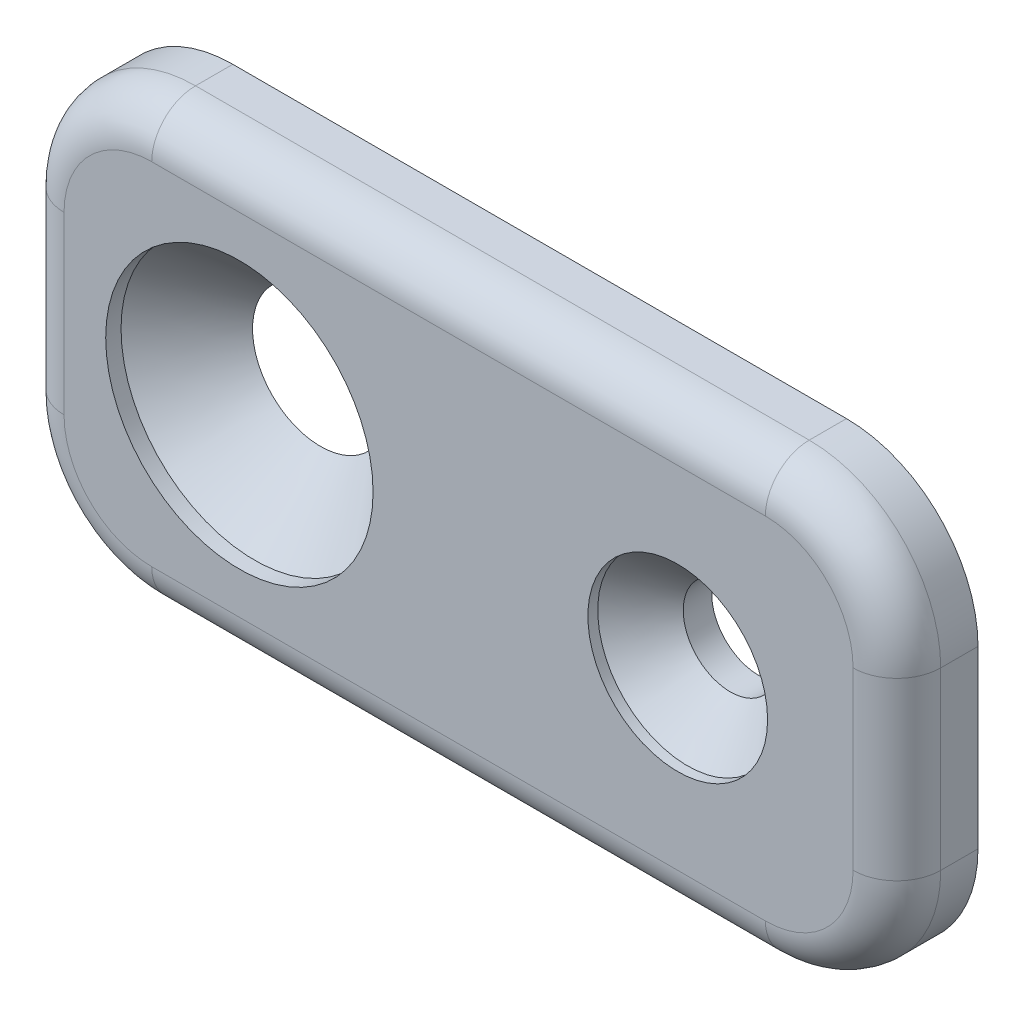
ISO-10303-21;
HEADER;
FILE_DESCRIPTION(('STEP AP214'),'2;1');
FILE_NAME('part.step','',(''),(''),'','','');
FILE_SCHEMA(('AUTOMOTIVE_DESIGN { 1 0 10303 214 1 1 1 1 }'));
ENDSEC;
DATA;
#1=APPLICATION_CONTEXT('core data for automotive mechanical design processes');
#2=APPLICATION_PROTOCOL_DEFINITION('international standard','automotive_design',2000,#1);
#3=PRODUCT_CONTEXT('',#1,'mechanical');
#4=PRODUCT('Part','Part','',(#3));
#5=PRODUCT_RELATED_PRODUCT_CATEGORY('part','',(#4));
#6=PRODUCT_DEFINITION_FORMATION('','',#4);
#7=PRODUCT_DEFINITION_CONTEXT('part definition',#1,'design');
#8=PRODUCT_DEFINITION('design','',#6,#7);
#9=PRODUCT_DEFINITION_SHAPE('','',#8);
#10=(LENGTH_UNIT() NAMED_UNIT(*) SI_UNIT(.MILLI.,.METRE.));
#11=(NAMED_UNIT(*) PLANE_ANGLE_UNIT() SI_UNIT($,.RADIAN.));
#12=(NAMED_UNIT(*) SI_UNIT($,.STERADIAN.) SOLID_ANGLE_UNIT());
#13=UNCERTAINTY_MEASURE_WITH_UNIT(LENGTH_MEASURE(1.E-05),#10,'distance_accuracy_value','');
#14=(GEOMETRIC_REPRESENTATION_CONTEXT(3) GLOBAL_UNCERTAINTY_ASSIGNED_CONTEXT((#13)) GLOBAL_UNIT_ASSIGNED_CONTEXT((#10,
#11,#12)) REPRESENTATION_CONTEXT('',''));
#15=CARTESIAN_POINT('',(0.,0.,0.));
#16=DIRECTION('',(0.,0.,1.));
#17=DIRECTION('',(1.,0.,0.));
#18=AXIS2_PLACEMENT_3D('',#15,#16,#17);
#19=CARTESIAN_POINT('',(20.,0.,3.7));
#20=DIRECTION('',(0.,0.,-1.));
#21=DIRECTION('',(-1.,0.,0.));
#22=AXIS2_PLACEMENT_3D('',#19,#20,#21);
#23=CYLINDRICAL_SURFACE('',#22,2.15);
#24=CARTESIAN_POINT('',(20.,0.,1.29999999999996));
#25=DIRECTION('',(0.,0.,1.));
#26=DIRECTION('',(1.,0.,0.));
#27=AXIS2_PLACEMENT_3D('',#24,#25,#26);
#28=CIRCLE('',#27,2.15);
#29=CARTESIAN_POINT('',(22.15,0.,1.29999999999996));
#30=VERTEX_POINT('',#29);
#31=EDGE_CURVE('E159',#30,#30,#28,.T.);
#32=ORIENTED_EDGE('',*,*,#31,.T.);
#33=EDGE_LOOP('',(#32));
#34=FACE_BOUND('',#33,.T.);
#35=CARTESIAN_POINT('',(20.,0.,0.));
#36=DIRECTION('',(0.,0.,1.));
#37=DIRECTION('',(1.,0.,0.));
#38=AXIS2_PLACEMENT_3D('',#35,#36,#37);
#39=CIRCLE('',#38,2.15);
#40=CARTESIAN_POINT('',(22.15,0.,0.));
#41=VERTEX_POINT('',#40);
#42=EDGE_CURVE('E252',#41,#41,#39,.T.);
#43=ORIENTED_EDGE('',*,*,#42,.F.);
#44=EDGE_LOOP('',(#43));
#45=FACE_BOUND('',#44,.T.);
#46=ADVANCED_FACE('F35',(#34,#45),#23,.F.);
#47=CARTESIAN_POINT('',(0.,0.,3.7));
#48=DIRECTION('',(0.,0.,-1.));
#49=DIRECTION('',(-1.,0.,0.));
#50=AXIS2_PLACEMENT_3D('',#47,#48,#49);
#51=PLANE('',#50);
#52=CARTESIAN_POINT('',(-4.,-4.00000000000001,3.7));
#53=DIRECTION('',(0.,0.,-1.));
#54=DIRECTION('',(-1.,0.,0.));
#55=AXIS2_PLACEMENT_3D('',#52,#53,#54);
#56=CIRCLE('',#55,4.);
#57=CARTESIAN_POINT('',(-8.,-4.00000000000001,3.7));
#58=VERTEX_POINT('',#57);
#59=CARTESIAN_POINT('',(-4.,-8.00000000000001,3.7));
#60=VERTEX_POINT('',#59);
#61=EDGE_CURVE('E185',#58,#60,#56,.F.);
#62=ORIENTED_EDGE('',*,*,#61,.T.);
#63=DIRECTION('',(1.,0.,0.));
#64=VECTOR('',#63,1.);
#65=CARTESIAN_POINT('',(0.,-8.00000000000001,3.7));
#66=LINE('',#65,#64);
#67=CARTESIAN_POINT('',(24.,-8.,3.7));
#68=VERTEX_POINT('',#67);
#69=EDGE_CURVE('E199',#60,#68,#66,.T.);
#70=ORIENTED_EDGE('',*,*,#69,.T.);
#71=CARTESIAN_POINT('',(24.,-4.,3.7));
#72=DIRECTION('',(0.,0.,-1.));
#73=DIRECTION('',(-1.,0.,0.));
#74=AXIS2_PLACEMENT_3D('',#71,#72,#73);
#75=CIRCLE('',#74,4.);
#76=CARTESIAN_POINT('',(28.,-4.,3.7));
#77=VERTEX_POINT('',#76);
#78=EDGE_CURVE('E197',#68,#77,#75,.F.);
#79=ORIENTED_EDGE('',*,*,#78,.T.);
#80=DIRECTION('',(0.,1.,0.));
#81=VECTOR('',#80,1.);
#82=CARTESIAN_POINT('',(28.,0.,3.7));
#83=LINE('',#82,#81);
#84=CARTESIAN_POINT('',(28.,4.,3.7));
#85=VERTEX_POINT('',#84);
#86=EDGE_CURVE('E195',#77,#85,#83,.T.);
#87=ORIENTED_EDGE('',*,*,#86,.T.);
#88=CARTESIAN_POINT('',(24.,4.,3.7));
#89=DIRECTION('',(0.,0.,-1.));
#90=DIRECTION('',(-1.,0.,0.));
#91=AXIS2_PLACEMENT_3D('',#88,#89,#90);
#92=CIRCLE('',#91,4.);
#93=CARTESIAN_POINT('',(24.,8.,3.7));
#94=VERTEX_POINT('',#93);
#95=EDGE_CURVE('E193',#85,#94,#92,.F.);
#96=ORIENTED_EDGE('',*,*,#95,.T.);
#97=DIRECTION('',(-1.,0.,0.));
#98=VECTOR('',#97,1.);
#99=CARTESIAN_POINT('',(0.,7.99999999999999,3.7));
#100=LINE('',#99,#98);
#101=CARTESIAN_POINT('',(-4.,7.99999999999999,3.7));
#102=VERTEX_POINT('',#101);
#103=EDGE_CURVE('E191',#94,#102,#100,.T.);
#104=ORIENTED_EDGE('',*,*,#103,.T.);
#105=CARTESIAN_POINT('',(-4.,3.99999999999999,3.7));
#106=DIRECTION('',(0.,0.,-1.));
#107=DIRECTION('',(-1.,0.,0.));
#108=AXIS2_PLACEMENT_3D('',#105,#106,#107);
#109=CIRCLE('',#108,4.);
#110=CARTESIAN_POINT('',(-8.,3.99999999999999,3.7));
#111=VERTEX_POINT('',#110);
#112=EDGE_CURVE('E189',#102,#111,#109,.F.);
#113=ORIENTED_EDGE('',*,*,#112,.T.);
#114=DIRECTION('',(0.,-1.,0.));
#115=VECTOR('',#114,1.);
#116=CARTESIAN_POINT('',(-8.,0.,3.7));
#117=LINE('',#116,#115);
#118=EDGE_CURVE('E187',#111,#58,#117,.T.);
#119=ORIENTED_EDGE('',*,*,#118,.T.);
#120=EDGE_LOOP('',(#62,#70,#79,#87,#96,#104,#113,#119));
#121=FACE_BOUND('',#120,.T.);
#122=CARTESIAN_POINT('',(20.,0.,3.7));
#123=DIRECTION('',(0.,0.,1.));
#124=DIRECTION('',(1.,0.,0.));
#125=AXIS2_PLACEMENT_3D('',#122,#123,#124);
#126=CIRCLE('',#125,4.1);
#127=CARTESIAN_POINT('',(24.1,0.,3.7));
#128=VERTEX_POINT('',#127);
#129=EDGE_CURVE('E237',#128,#128,#126,.T.);
#130=ORIENTED_EDGE('',*,*,#129,.F.);
#131=EDGE_LOOP('',(#130));
#132=FACE_BOUND('',#131,.T.);
#133=CARTESIAN_POINT('',(0.,0.,3.7));
#134=DIRECTION('',(0.,0.,1.));
#135=DIRECTION('',(1.,0.,0.));
#136=AXIS2_PLACEMENT_3D('',#133,#134,#135);
#137=CIRCLE('',#136,6.1);
#138=CARTESIAN_POINT('',(6.1,0.,3.7));
#139=VERTEX_POINT('',#138);
#140=EDGE_CURVE('E243',#139,#139,#137,.T.);
#141=ORIENTED_EDGE('',*,*,#140,.F.);
#142=EDGE_LOOP('',(#141));
#143=FACE_BOUND('',#142,.T.);
#144=ADVANCED_FACE('F278',(#121,#132,#143),#51,.F.);
#145=CARTESIAN_POINT('',(0.,0.,0.));
#146=DIRECTION('',(0.,0.,-1.));
#147=DIRECTION('',(-1.,0.,0.));
#148=AXIS2_PLACEMENT_3D('',#145,#146,#147);
#149=PLANE('',#148);
#150=CARTESIAN_POINT('',(0.,0.,0.));
#151=DIRECTION('',(0.,0.,1.));
#152=DIRECTION('',(1.,0.,0.));
#153=AXIS2_PLACEMENT_3D('',#150,#151,#152);
#154=CIRCLE('',#153,3.1);
#155=CARTESIAN_POINT('',(3.1,0.,0.));
#156=VERTEX_POINT('',#155);
#157=EDGE_CURVE('E256',#156,#156,#154,.T.);
#158=ORIENTED_EDGE('',*,*,#157,.T.);
#159=EDGE_LOOP('',(#158));
#160=FACE_BOUND('',#159,.T.);
#161=DIRECTION('',(0.,1.,0.));
#162=VECTOR('',#161,1.);
#163=CARTESIAN_POINT('',(30.,10.,0.));
#164=LINE('',#163,#162);
#165=CARTESIAN_POINT('',(30.,-4.,0.));
#166=VERTEX_POINT('',#165);
#167=CARTESIAN_POINT('',(30.,4.,0.));
#168=VERTEX_POINT('',#167);
#169=EDGE_CURVE('E130',#166,#168,#164,.T.);
#170=ORIENTED_EDGE('',*,*,#169,.F.);
#171=CARTESIAN_POINT('',(24.,-4.,0.));
#172=DIRECTION('',(0.,0.,-1.));
#173=DIRECTION('',(-1.,0.,0.));
#174=AXIS2_PLACEMENT_3D('',#171,#172,#173);
#175=CIRCLE('',#174,6.);
#176=CARTESIAN_POINT('',(24.,-10.,0.));
#177=VERTEX_POINT('',#176);
#178=EDGE_CURVE('E140',#166,#177,#175,.T.);
#179=ORIENTED_EDGE('',*,*,#178,.T.);
#180=DIRECTION('',(1.,0.,0.));
#181=VECTOR('',#180,1.);
#182=CARTESIAN_POINT('',(30.,-10.,0.));
#183=LINE('',#182,#181);
#184=CARTESIAN_POINT('',(-4.,-10.,0.));
#185=VERTEX_POINT('',#184);
#186=EDGE_CURVE('E156',#185,#177,#183,.T.);
#187=ORIENTED_EDGE('',*,*,#186,.F.);
#188=CARTESIAN_POINT('',(-4.,-4.00000000000001,0.));
#189=DIRECTION('',(0.,0.,-1.));
#190=DIRECTION('',(-1.,0.,0.));
#191=AXIS2_PLACEMENT_3D('',#188,#189,#190);
#192=CIRCLE('',#191,6.);
#193=CARTESIAN_POINT('',(-10.,-4.00000000000001,0.));
#194=VERTEX_POINT('',#193);
#195=EDGE_CURVE('E148',#185,#194,#192,.T.);
#196=ORIENTED_EDGE('',*,*,#195,.T.);
#197=DIRECTION('',(0.,-1.,0.));
#198=VECTOR('',#197,1.);
#199=CARTESIAN_POINT('',(-10.,9.99999999999999,0.));
#200=LINE('',#199,#198);
#201=CARTESIAN_POINT('',(-10.,3.99999999999999,0.));
#202=VERTEX_POINT('',#201);
#203=EDGE_CURVE('E161',#202,#194,#200,.T.);
#204=ORIENTED_EDGE('',*,*,#203,.F.);
#205=CARTESIAN_POINT('',(-4.,3.99999999999999,0.));
#206=DIRECTION('',(0.,0.,-1.));
#207=DIRECTION('',(-1.,0.,0.));
#208=AXIS2_PLACEMENT_3D('',#205,#206,#207);
#209=CIRCLE('',#208,6.);
#210=CARTESIAN_POINT('',(-4.,9.99999999999999,0.));
#211=VERTEX_POINT('',#210);
#212=EDGE_CURVE('E136',#202,#211,#209,.T.);
#213=ORIENTED_EDGE('',*,*,#212,.T.);
#214=DIRECTION('',(-1.,0.,0.));
#215=VECTOR('',#214,1.);
#216=CARTESIAN_POINT('',(30.,10.,0.));
#217=LINE('',#216,#215);
#218=CARTESIAN_POINT('',(24.,10.,0.));
#219=VERTEX_POINT('',#218);
#220=EDGE_CURVE('E155',#219,#211,#217,.T.);
#221=ORIENTED_EDGE('',*,*,#220,.F.);
#222=CARTESIAN_POINT('',(24.,4.,0.));
#223=DIRECTION('',(0.,0.,-1.));
#224=DIRECTION('',(-1.,0.,0.));
#225=AXIS2_PLACEMENT_3D('',#222,#223,#224);
#226=CIRCLE('',#225,6.);
#227=EDGE_CURVE('E154',#219,#168,#226,.T.);
#228=ORIENTED_EDGE('',*,*,#227,.T.);
#229=EDGE_LOOP('',(#170,#179,#187,#196,#204,#213,#221,#228));
#230=FACE_BOUND('',#229,.T.);
#231=ORIENTED_EDGE('',*,*,#42,.T.);
#232=EDGE_LOOP('',(#231));
#233=FACE_BOUND('',#232,.T.);
#234=ADVANCED_FACE('F150',(#160,#230,#233),#149,.T.);
#235=CARTESIAN_POINT('',(-10.,9.99999999999999,3.7));
#236=DIRECTION('',(1.,0.,0.));
#237=DIRECTION('',(0.,1.,0.));
#238=AXIS2_PLACEMENT_3D('',#235,#236,#237);
#239=PLANE('',#238);
#240=DIRECTION('',(0.,0.,-1.));
#241=VECTOR('',#240,1.);
#242=CARTESIAN_POINT('',(-10.,-4.00000000000001,3.7));
#243=LINE('',#242,#241);
#244=CARTESIAN_POINT('',(-10.,-4.00000000000001,1.7));
#245=VERTEX_POINT('',#244);
#246=EDGE_CURVE('E178',#194,#245,#243,.F.);
#247=ORIENTED_EDGE('',*,*,#246,.T.);
#248=DIRECTION('',(0.,-1.,0.));
#249=VECTOR('',#248,1.);
#250=CARTESIAN_POINT('',(-10.,9.99999999999999,1.7));
#251=LINE('',#250,#249);
#252=CARTESIAN_POINT('',(-10.,3.99999999999999,1.7));
#253=VERTEX_POINT('',#252);
#254=EDGE_CURVE('E44',#245,#253,#251,.F.);
#255=ORIENTED_EDGE('',*,*,#254,.T.);
#256=DIRECTION('',(0.,0.,-1.));
#257=VECTOR('',#256,1.);
#258=CARTESIAN_POINT('',(-10.,3.99999999999999,3.7));
#259=LINE('',#258,#257);
#260=EDGE_CURVE('E176',#253,#202,#259,.T.);
#261=ORIENTED_EDGE('',*,*,#260,.T.);
#262=ORIENTED_EDGE('',*,*,#203,.T.);
#263=EDGE_LOOP('',(#247,#255,#261,#262));
#264=FACE_BOUND('',#263,.T.);
#265=ADVANCED_FACE('F260',(#264),#239,.F.);
#266=CARTESIAN_POINT('',(30.,-10.,3.7));
#267=DIRECTION('',(0.,1.,0.));
#268=DIRECTION('',(-1.,0.,0.));
#269=AXIS2_PLACEMENT_3D('',#266,#267,#268);
#270=PLANE('',#269);
#271=DIRECTION('',(0.,0.,-1.));
#272=VECTOR('',#271,1.);
#273=CARTESIAN_POINT('',(24.,-10.,3.7));
#274=LINE('',#273,#272);
#275=CARTESIAN_POINT('',(24.,-10.,1.7));
#276=VERTEX_POINT('',#275);
#277=EDGE_CURVE('E143',#177,#276,#274,.F.);
#278=ORIENTED_EDGE('',*,*,#277,.T.);
#279=DIRECTION('',(1.,0.,0.));
#280=VECTOR('',#279,1.);
#281=CARTESIAN_POINT('',(30.,-10.,1.7));
#282=LINE('',#281,#280);
#283=CARTESIAN_POINT('',(-4.,-10.,1.7));
#284=VERTEX_POINT('',#283);
#285=EDGE_CURVE('E202',#276,#284,#282,.F.);
#286=ORIENTED_EDGE('',*,*,#285,.T.);
#287=DIRECTION('',(0.,0.,-1.));
#288=VECTOR('',#287,1.);
#289=CARTESIAN_POINT('',(-4.,-10.,3.7));
#290=LINE('',#289,#288);
#291=EDGE_CURVE('E147',#284,#185,#290,.T.);
#292=ORIENTED_EDGE('',*,*,#291,.T.);
#293=ORIENTED_EDGE('',*,*,#186,.T.);
#294=EDGE_LOOP('',(#278,#286,#292,#293));
#295=FACE_BOUND('',#294,.T.);
#296=ADVANCED_FACE('F265',(#295),#270,.F.);
#297=CARTESIAN_POINT('',(30.,10.,3.7));
#298=DIRECTION('',(-1.,0.,0.));
#299=DIRECTION('',(0.,0.,1.));
#300=AXIS2_PLACEMENT_3D('',#297,#298,#299);
#301=PLANE('',#300);
#302=DIRECTION('',(0.,0.,-1.));
#303=VECTOR('',#302,1.);
#304=CARTESIAN_POINT('',(30.,4.,3.7));
#305=LINE('',#304,#303);
#306=CARTESIAN_POINT('',(30.,4.,1.7));
#307=VERTEX_POINT('',#306);
#308=EDGE_CURVE('E137',#168,#307,#305,.F.);
#309=ORIENTED_EDGE('',*,*,#308,.T.);
#310=DIRECTION('',(0.,1.,0.));
#311=VECTOR('',#310,1.);
#312=CARTESIAN_POINT('',(30.,10.,1.7));
#313=LINE('',#312,#311);
#314=CARTESIAN_POINT('',(30.,-4.,1.7));
#315=VERTEX_POINT('',#314);
#316=EDGE_CURVE('E133',#307,#315,#313,.F.);
#317=ORIENTED_EDGE('',*,*,#316,.T.);
#318=DIRECTION('',(0.,0.,-1.));
#319=VECTOR('',#318,1.);
#320=CARTESIAN_POINT('',(30.,-4.,3.7));
#321=LINE('',#320,#319);
#322=EDGE_CURVE('E125',#315,#166,#321,.T.);
#323=ORIENTED_EDGE('',*,*,#322,.T.);
#324=ORIENTED_EDGE('',*,*,#169,.T.);
#325=EDGE_LOOP('',(#309,#317,#323,#324));
#326=FACE_BOUND('',#325,.T.);
#327=ADVANCED_FACE('F128',(#326),#301,.F.);
#328=CARTESIAN_POINT('',(30.,10.,3.7));
#329=DIRECTION('',(0.,-1.,0.));
#330=DIRECTION('',(1.,0.,0.));
#331=AXIS2_PLACEMENT_3D('',#328,#329,#330);
#332=PLANE('',#331);
#333=DIRECTION('',(0.,0.,-1.));
#334=VECTOR('',#333,1.);
#335=CARTESIAN_POINT('',(-4.,9.99999999999999,3.7));
#336=LINE('',#335,#334);
#337=CARTESIAN_POINT('',(-4.,9.99999999999999,1.7));
#338=VERTEX_POINT('',#337);
#339=EDGE_CURVE('E180',#211,#338,#336,.F.);
#340=ORIENTED_EDGE('',*,*,#339,.T.);
#341=DIRECTION('',(-1.,0.,0.));
#342=VECTOR('',#341,1.);
#343=CARTESIAN_POINT('',(30.,10.,1.7));
#344=LINE('',#343,#342);
#345=CARTESIAN_POINT('',(24.,10.,1.7));
#346=VERTEX_POINT('',#345);
#347=EDGE_CURVE('E210',#338,#346,#344,.F.);
#348=ORIENTED_EDGE('',*,*,#347,.T.);
#349=DIRECTION('',(0.,0.,-1.));
#350=VECTOR('',#349,1.);
#351=CARTESIAN_POINT('',(24.,10.,3.7));
#352=LINE('',#351,#350);
#353=EDGE_CURVE('E183',#346,#219,#352,.T.);
#354=ORIENTED_EDGE('',*,*,#353,.T.);
#355=ORIENTED_EDGE('',*,*,#220,.T.);
#356=EDGE_LOOP('',(#340,#348,#354,#355));
#357=FACE_BOUND('',#356,.T.);
#358=ADVANCED_FACE('F294',(#357),#332,.F.);
#359=CARTESIAN_POINT('',(0.,0.,3.));
#360=DIRECTION('',(0.,0.,1.));
#361=DIRECTION('',(1.,0.,0.));
#362=AXIS2_PLACEMENT_3D('',#359,#360,#361);
#363=CYLINDRICAL_SURFACE('',#362,6.1);
#364=CARTESIAN_POINT('',(0.,0.,3.));
#365=DIRECTION('',(0.,0.,1.));
#366=DIRECTION('',(1.,0.,0.));
#367=AXIS2_PLACEMENT_3D('',#364,#365,#366);
#368=CIRCLE('',#367,6.1);
#369=CARTESIAN_POINT('',(6.1,0.,3.));
#370=VERTEX_POINT('',#369);
#371=EDGE_CURVE('E248',#370,#370,#368,.T.);
#372=ORIENTED_EDGE('',*,*,#371,.F.);
#373=EDGE_LOOP('',(#372));
#374=FACE_BOUND('',#373,.T.);
#375=ORIENTED_EDGE('',*,*,#140,.T.);
#376=EDGE_LOOP('',(#375));
#377=FACE_BOUND('',#376,.T.);
#378=ADVANCED_FACE('F319',(#374,#377),#363,.F.);
#379=CARTESIAN_POINT('',(0.,0.,0.));
#380=DIRECTION('',(0.,0.,1.));
#381=DIRECTION('',(1.,0.,0.));
#382=AXIS2_PLACEMENT_3D('',#379,#380,#381);
#383=CONICAL_SURFACE('',#382,3.1,0.78539816339745);
#384=ORIENTED_EDGE('',*,*,#371,.T.);
#385=EDGE_LOOP('',(#384));
#386=FACE_BOUND('',#385,.T.);
#387=ORIENTED_EDGE('',*,*,#157,.F.);
#388=EDGE_LOOP('',(#387));
#389=FACE_BOUND('',#388,.T.);
#390=ADVANCED_FACE('F333',(#386,#389),#383,.F.);
#391=CARTESIAN_POINT('',(20.,0.,3.3));
#392=DIRECTION('',(0.,0.,1.));
#393=DIRECTION('',(1.,0.,0.));
#394=AXIS2_PLACEMENT_3D('',#391,#392,#393);
#395=CYLINDRICAL_SURFACE('',#394,4.1);
#396=CARTESIAN_POINT('',(20.,0.,3.24999999999999));
#397=DIRECTION('',(0.,0.,1.));
#398=DIRECTION('',(1.,0.,0.));
#399=AXIS2_PLACEMENT_3D('',#396,#397,#398);
#400=CIRCLE('',#399,4.1);
#401=CARTESIAN_POINT('',(24.1,0.,3.24999999999999));
#402=VERTEX_POINT('',#401);
#403=EDGE_CURVE('E167',#402,#402,#400,.F.);
#404=ORIENTED_EDGE('',*,*,#403,.T.);
#405=EDGE_LOOP('',(#404));
#406=FACE_BOUND('',#405,.T.);
#407=ORIENTED_EDGE('',*,*,#129,.T.);
#408=EDGE_LOOP('',(#407));
#409=FACE_BOUND('',#408,.T.);
#410=ADVANCED_FACE('F336',(#406,#409),#395,.F.);
#411=CARTESIAN_POINT('',(20.,0.,1.29999999999996));
#412=DIRECTION('',(0.,0.,1.));
#413=DIRECTION('',(1.,0.,0.));
#414=AXIS2_PLACEMENT_3D('',#411,#412,#413);
#415=CONICAL_SURFACE('',#414,2.15,0.785398163397443);
#416=ORIENTED_EDGE('',*,*,#403,.F.);
#417=EDGE_LOOP('',(#416));
#418=FACE_BOUND('',#417,.T.);
#419=ORIENTED_EDGE('',*,*,#31,.F.);
#420=EDGE_LOOP('',(#419));
#421=FACE_BOUND('',#420,.T.);
#422=ADVANCED_FACE('F338',(#418,#421),#415,.F.);
#423=CARTESIAN_POINT('',(24.,-4.,3.7));
#424=DIRECTION('',(0.,0.,-1.));
#425=DIRECTION('',(-1.,0.,0.));
#426=AXIS2_PLACEMENT_3D('',#423,#424,#425);
#427=CYLINDRICAL_SURFACE('',#426,6.);
#428=ORIENTED_EDGE('',*,*,#322,.F.);
#429=CARTESIAN_POINT('',(24.,-4.,1.7));
#430=DIRECTION('',(0.,0.,-1.));
#431=DIRECTION('',(-1.,0.,0.));
#432=AXIS2_PLACEMENT_3D('',#429,#430,#431);
#433=CIRCLE('',#432,6.);
#434=EDGE_CURVE('E205',#315,#276,#433,.T.);
#435=ORIENTED_EDGE('',*,*,#434,.T.);
#436=ORIENTED_EDGE('',*,*,#277,.F.);
#437=ORIENTED_EDGE('',*,*,#178,.F.);
#438=EDGE_LOOP('',(#428,#435,#436,#437));
#439=FACE_BOUND('',#438,.T.);
#440=ADVANCED_FACE('F141',(#439),#427,.T.);
#441=CARTESIAN_POINT('',(-4.,-4.00000000000001,3.7));
#442=DIRECTION('',(0.,0.,-1.));
#443=DIRECTION('',(-1.,0.,0.));
#444=AXIS2_PLACEMENT_3D('',#441,#442,#443);
#445=CYLINDRICAL_SURFACE('',#444,6.);
#446=ORIENTED_EDGE('',*,*,#291,.F.);
#447=CARTESIAN_POINT('',(-4.,-4.00000000000001,1.7));
#448=DIRECTION('',(0.,0.,-1.));
#449=DIRECTION('',(-1.,0.,0.));
#450=AXIS2_PLACEMENT_3D('',#447,#448,#449);
#451=CIRCLE('',#450,6.);
#452=EDGE_CURVE('E11',#284,#245,#451,.T.);
#453=ORIENTED_EDGE('',*,*,#452,.T.);
#454=ORIENTED_EDGE('',*,*,#246,.F.);
#455=ORIENTED_EDGE('',*,*,#195,.F.);
#456=EDGE_LOOP('',(#446,#453,#454,#455));
#457=FACE_BOUND('',#456,.T.);
#458=ADVANCED_FACE('F263',(#457),#445,.T.);
#459=CARTESIAN_POINT('',(24.,4.,3.7));
#460=DIRECTION('',(0.,0.,-1.));
#461=DIRECTION('',(-1.,0.,0.));
#462=AXIS2_PLACEMENT_3D('',#459,#460,#461);
#463=CYLINDRICAL_SURFACE('',#462,6.);
#464=ORIENTED_EDGE('',*,*,#353,.F.);
#465=CARTESIAN_POINT('',(24.,4.,1.7));
#466=DIRECTION('',(0.,0.,-1.));
#467=DIRECTION('',(-1.,0.,0.));
#468=AXIS2_PLACEMENT_3D('',#465,#466,#467);
#469=CIRCLE('',#468,6.);
#470=EDGE_CURVE('E208',#346,#307,#469,.T.);
#471=ORIENTED_EDGE('',*,*,#470,.T.);
#472=ORIENTED_EDGE('',*,*,#308,.F.);
#473=ORIENTED_EDGE('',*,*,#227,.F.);
#474=EDGE_LOOP('',(#464,#471,#472,#473));
#475=FACE_BOUND('',#474,.T.);
#476=ADVANCED_FACE('F301',(#475),#463,.T.);
#477=CARTESIAN_POINT('',(-4.,3.99999999999999,3.7));
#478=DIRECTION('',(0.,0.,-1.));
#479=DIRECTION('',(-1.,0.,0.));
#480=AXIS2_PLACEMENT_3D('',#477,#478,#479);
#481=CYLINDRICAL_SURFACE('',#480,6.);
#482=ORIENTED_EDGE('',*,*,#260,.F.);
#483=CARTESIAN_POINT('',(-4.,3.99999999999999,1.7));
#484=DIRECTION('',(0.,0.,-1.));
#485=DIRECTION('',(-1.,0.,0.));
#486=AXIS2_PLACEMENT_3D('',#483,#484,#485);
#487=CIRCLE('',#486,6.);
#488=EDGE_CURVE('E212',#253,#338,#487,.T.);
#489=ORIENTED_EDGE('',*,*,#488,.T.);
#490=ORIENTED_EDGE('',*,*,#339,.F.);
#491=ORIENTED_EDGE('',*,*,#212,.F.);
#492=EDGE_LOOP('',(#482,#489,#490,#491));
#493=FACE_BOUND('',#492,.T.);
#494=ADVANCED_FACE('F291',(#493),#481,.T.);
#495=CARTESIAN_POINT('',(0.,7.99999999999999,1.7));
#496=DIRECTION('',(-1.,0.,0.));
#497=DIRECTION('',(0.,-1.,0.));
#498=AXIS2_PLACEMENT_3D('',#495,#496,#497);
#499=CYLINDRICAL_SURFACE('',#498,2.);
#500=CARTESIAN_POINT('',(24.,8.,1.7));
#501=DIRECTION('',(1.,0.,0.));
#502=DIRECTION('',(0.,0.,-1.));
#503=AXIS2_PLACEMENT_3D('',#500,#501,#502);
#504=CIRCLE('',#503,2.);
#505=EDGE_CURVE('E230',#346,#94,#504,.T.);
#506=ORIENTED_EDGE('',*,*,#505,.F.);
#507=ORIENTED_EDGE('',*,*,#347,.F.);
#508=CARTESIAN_POINT('',(-4.,7.99999999999999,1.7));
#509=DIRECTION('',(-1.,0.,0.));
#510=DIRECTION('',(0.,0.,1.));
#511=AXIS2_PLACEMENT_3D('',#508,#509,#510);
#512=CIRCLE('',#511,2.);
#513=EDGE_CURVE('E39',#102,#338,#512,.T.);
#514=ORIENTED_EDGE('',*,*,#513,.F.);
#515=ORIENTED_EDGE('',*,*,#103,.F.);
#516=EDGE_LOOP('',(#506,#507,#514,#515));
#517=FACE_BOUND('',#516,.T.);
#518=ADVANCED_FACE('F37',(#517),#499,.T.);
#519=CARTESIAN_POINT('',(-4.,3.99999999999999,1.7));
#520=DIRECTION('',(0.,0.,-1.));
#521=DIRECTION('',(-1.,0.,0.));
#522=AXIS2_PLACEMENT_3D('',#519,#520,#521);
#523=TOROIDAL_SURFACE('',#522,4.,2.);
#524=ORIENTED_EDGE('',*,*,#513,.T.);
#525=ORIENTED_EDGE('',*,*,#488,.F.);
#526=CARTESIAN_POINT('',(-8.,3.99999999999999,1.7));
#527=DIRECTION('',(0.,-1.,0.));
#528=DIRECTION('',(0.,0.,-1.));
#529=AXIS2_PLACEMENT_3D('',#526,#527,#528);
#530=CIRCLE('',#529,2.);
#531=EDGE_CURVE('E228',#111,#253,#530,.T.);
#532=ORIENTED_EDGE('',*,*,#531,.F.);
#533=ORIENTED_EDGE('',*,*,#112,.F.);
#534=EDGE_LOOP('',(#524,#525,#532,#533));
#535=FACE_BOUND('',#534,.T.);
#536=ADVANCED_FACE('F288',(#535),#523,.T.);
#537=CARTESIAN_POINT('',(24.,4.,1.7));
#538=DIRECTION('',(0.,0.,-1.));
#539=DIRECTION('',(-1.,0.,0.));
#540=AXIS2_PLACEMENT_3D('',#537,#538,#539);
#541=TOROIDAL_SURFACE('',#540,4.,2.);
#542=ORIENTED_EDGE('',*,*,#505,.T.);
#543=ORIENTED_EDGE('',*,*,#95,.F.);
#544=CARTESIAN_POINT('',(28.,4.,1.7));
#545=DIRECTION('',(0.,-1.,0.));
#546=DIRECTION('',(0.,0.,-1.));
#547=AXIS2_PLACEMENT_3D('',#544,#545,#546);
#548=CIRCLE('',#547,2.);
#549=EDGE_CURVE('E225',#307,#85,#548,.T.);
#550=ORIENTED_EDGE('',*,*,#549,.F.);
#551=ORIENTED_EDGE('',*,*,#470,.F.);
#552=EDGE_LOOP('',(#542,#543,#550,#551));
#553=FACE_BOUND('',#552,.T.);
#554=ADVANCED_FACE('F299',(#553),#541,.T.);
#555=CARTESIAN_POINT('',(-8.,0.,1.7));
#556=DIRECTION('',(0.,-1.,0.));
#557=DIRECTION('',(1.,0.,0.));
#558=AXIS2_PLACEMENT_3D('',#555,#556,#557);
#559=CYLINDRICAL_SURFACE('',#558,2.);
#560=ORIENTED_EDGE('',*,*,#531,.T.);
#561=ORIENTED_EDGE('',*,*,#254,.F.);
#562=CARTESIAN_POINT('',(-8.,-4.00000000000001,1.7));
#563=DIRECTION('',(0.,-1.,0.));
#564=DIRECTION('',(0.,0.,-1.));
#565=AXIS2_PLACEMENT_3D('',#562,#563,#564);
#566=CIRCLE('',#565,2.);
#567=EDGE_CURVE('E222',#58,#245,#566,.T.);
#568=ORIENTED_EDGE('',*,*,#567,.F.);
#569=ORIENTED_EDGE('',*,*,#118,.F.);
#570=EDGE_LOOP('',(#560,#561,#568,#569));
#571=FACE_BOUND('',#570,.T.);
#572=ADVANCED_FACE('F286',(#571),#559,.T.);
#573=CARTESIAN_POINT('',(28.,0.,1.7));
#574=DIRECTION('',(0.,1.,0.));
#575=DIRECTION('',(0.,0.,1.));
#576=AXIS2_PLACEMENT_3D('',#573,#574,#575);
#577=CYLINDRICAL_SURFACE('',#576,2.);
#578=ORIENTED_EDGE('',*,*,#549,.T.);
#579=ORIENTED_EDGE('',*,*,#86,.F.);
#580=CARTESIAN_POINT('',(28.,-4.,1.7));
#581=DIRECTION('',(0.,-1.,0.));
#582=DIRECTION('',(0.,0.,-1.));
#583=AXIS2_PLACEMENT_3D('',#580,#581,#582);
#584=CIRCLE('',#583,2.);
#585=EDGE_CURVE('E219',#315,#77,#584,.T.);
#586=ORIENTED_EDGE('',*,*,#585,.F.);
#587=ORIENTED_EDGE('',*,*,#316,.F.);
#588=EDGE_LOOP('',(#578,#579,#586,#587));
#589=FACE_BOUND('',#588,.T.);
#590=ADVANCED_FACE('F396',(#589),#577,.T.);
#591=CARTESIAN_POINT('',(-4.,-4.00000000000001,1.7));
#592=DIRECTION('',(0.,0.,-1.));
#593=DIRECTION('',(-1.,0.,0.));
#594=AXIS2_PLACEMENT_3D('',#591,#592,#593);
#595=TOROIDAL_SURFACE('',#594,4.,2.);
#596=ORIENTED_EDGE('',*,*,#567,.T.);
#597=ORIENTED_EDGE('',*,*,#452,.F.);
#598=CARTESIAN_POINT('',(-4.,-8.00000000000001,1.7));
#599=DIRECTION('',(1.,0.,0.));
#600=DIRECTION('',(0.,0.,-1.));
#601=AXIS2_PLACEMENT_3D('',#598,#599,#600);
#602=CIRCLE('',#601,2.);
#603=EDGE_CURVE('E217',#60,#284,#602,.T.);
#604=ORIENTED_EDGE('',*,*,#603,.F.);
#605=ORIENTED_EDGE('',*,*,#61,.F.);
#606=EDGE_LOOP('',(#596,#597,#604,#605));
#607=FACE_BOUND('',#606,.T.);
#608=ADVANCED_FACE('F284',(#607),#595,.T.);
#609=CARTESIAN_POINT('',(24.,-4.,1.7));
#610=DIRECTION('',(0.,0.,-1.));
#611=DIRECTION('',(-1.,0.,0.));
#612=AXIS2_PLACEMENT_3D('',#609,#610,#611);
#613=TOROIDAL_SURFACE('',#612,4.,2.);
#614=ORIENTED_EDGE('',*,*,#585,.T.);
#615=ORIENTED_EDGE('',*,*,#78,.F.);
#616=CARTESIAN_POINT('',(24.,-8.,1.7));
#617=DIRECTION('',(-1.,0.,0.));
#618=DIRECTION('',(0.,0.,1.));
#619=AXIS2_PLACEMENT_3D('',#616,#617,#618);
#620=CIRCLE('',#619,2.);
#621=EDGE_CURVE('E215',#276,#68,#620,.T.);
#622=ORIENTED_EDGE('',*,*,#621,.F.);
#623=ORIENTED_EDGE('',*,*,#434,.F.);
#624=EDGE_LOOP('',(#614,#615,#622,#623));
#625=FACE_BOUND('',#624,.T.);
#626=ADVANCED_FACE('F275',(#625),#613,.T.);
#627=CARTESIAN_POINT('',(0.,-8.00000000000001,1.7));
#628=DIRECTION('',(1.,0.,0.));
#629=DIRECTION('',(0.,1.,0.));
#630=AXIS2_PLACEMENT_3D('',#627,#628,#629);
#631=CYLINDRICAL_SURFACE('',#630,2.);
#632=ORIENTED_EDGE('',*,*,#603,.T.);
#633=ORIENTED_EDGE('',*,*,#285,.F.);
#634=ORIENTED_EDGE('',*,*,#621,.T.);
#635=ORIENTED_EDGE('',*,*,#69,.F.);
#636=EDGE_LOOP('',(#632,#633,#634,#635));
#637=FACE_BOUND('',#636,.T.);
#638=ADVANCED_FACE('F269',(#637),#631,.T.);
#639=CLOSED_SHELL('',(#46,#144,#234,#265,#296,#327,#358,#378,#390,#410,#422,#440,#458,#476,#494,
#518,#536,#554,#572,#590,#608,#626,#638));
#640=MANIFOLD_SOLID_BREP('B2',#639);
#641=ADVANCED_BREP_SHAPE_REPRESENTATION('',(#18,#640),#14);
#642=SHAPE_DEFINITION_REPRESENTATION(#9,#641);
ENDSEC;
END-ISO-10303-21;
